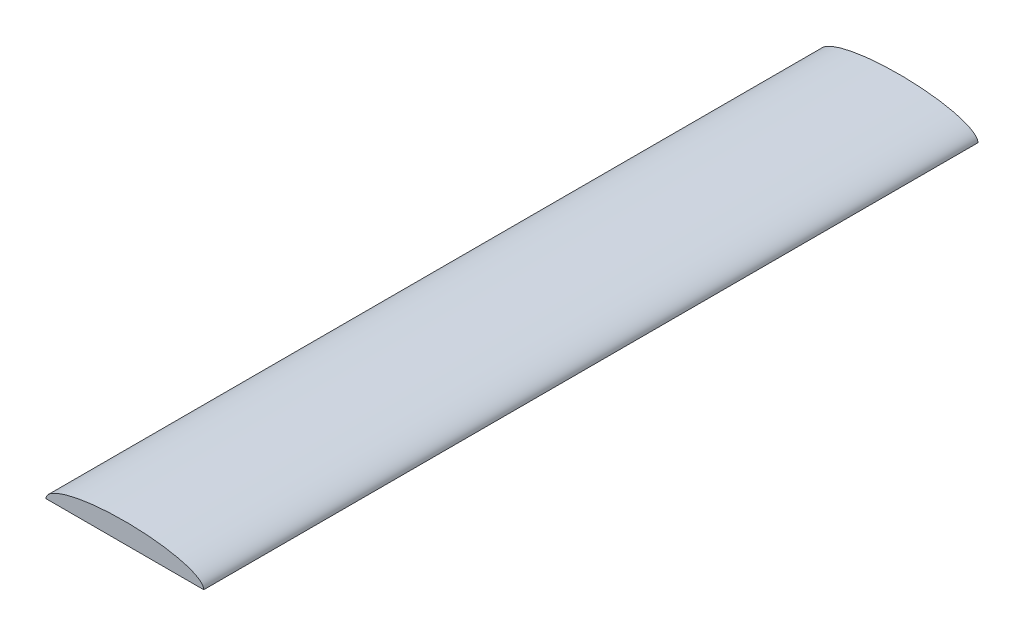
ISO-10303-21;
HEADER;
FILE_DESCRIPTION(('STEP AP214'),'2;1');
FILE_NAME('part.step','',(''),(''),'','','');
FILE_SCHEMA(('AUTOMOTIVE_DESIGN { 1 0 10303 214 1 1 1 1 }'));
ENDSEC;
DATA;
#1=APPLICATION_CONTEXT('core data for automotive mechanical design processes');
#2=APPLICATION_PROTOCOL_DEFINITION('international standard','automotive_design',2000,#1);
#3=PRODUCT_CONTEXT('',#1,'mechanical');
#4=PRODUCT('Part','Part','',(#3));
#5=PRODUCT_RELATED_PRODUCT_CATEGORY('part','',(#4));
#6=PRODUCT_DEFINITION_FORMATION('','',#4);
#7=PRODUCT_DEFINITION_CONTEXT('part definition',#1,'design');
#8=PRODUCT_DEFINITION('design','',#6,#7);
#9=PRODUCT_DEFINITION_SHAPE('','',#8);
#10=(LENGTH_UNIT() NAMED_UNIT(*) SI_UNIT(.MILLI.,.METRE.));
#11=(NAMED_UNIT(*) PLANE_ANGLE_UNIT() SI_UNIT($,.RADIAN.));
#12=(NAMED_UNIT(*) SI_UNIT($,.STERADIAN.) SOLID_ANGLE_UNIT());
#13=UNCERTAINTY_MEASURE_WITH_UNIT(LENGTH_MEASURE(1.E-05),#10,'distance_accuracy_value','');
#14=(GEOMETRIC_REPRESENTATION_CONTEXT(3) GLOBAL_UNCERTAINTY_ASSIGNED_CONTEXT((#13)) GLOBAL_UNIT_ASSIGNED_CONTEXT((#10,
#11,#12)) REPRESENTATION_CONTEXT('',''));
#15=CARTESIAN_POINT('',(0.,0.,0.));
#16=DIRECTION('',(0.,0.,1.));
#17=DIRECTION('',(1.,0.,0.));
#18=AXIS2_PLACEMENT_3D('',#15,#16,#17);
#19=CARTESIAN_POINT('',(0.,0.,12.35));
#20=DIRECTION('',(0.,0.,1.));
#21=DIRECTION('',(1.,0.,0.));
#22=AXIS2_PLACEMENT_3D('',#19,#20,#21);
#23=ELLIPSE('',#22,2.516,0.635);
#24=DIRECTION('',(0.,0.,-1.));
#25=VECTOR('',#24,1.);
#26=SURFACE_OF_LINEAR_EXTRUSION('',#23,#25);
#27=CARTESIAN_POINT('',(0.,0.,-12.35));
#28=DIRECTION('',(0.,0.,1.));
#29=DIRECTION('',(1.,0.,0.));
#30=AXIS2_PLACEMENT_3D('',#27,#28,#29);
#31=ELLIPSE('',#30,2.516,0.635);
#32=CARTESIAN_POINT('',(2.516,0.,-12.35));
#33=VERTEX_POINT('',#32);
#34=CARTESIAN_POINT('',(-2.516,0.,-12.35));
#35=VERTEX_POINT('',#34);
#36=EDGE_CURVE('E62',#33,#35,#31,.T.);
#37=ORIENTED_EDGE('',*,*,#36,.T.);
#38=DIRECTION('',(0.,0.,-1.));
#39=VECTOR('',#38,1.);
#40=CARTESIAN_POINT('',(-2.516,0.,12.35));
#41=LINE('',#40,#39);
#42=CARTESIAN_POINT('',(-2.516,0.,12.35));
#43=VERTEX_POINT('',#42);
#44=EDGE_CURVE('E11',#43,#35,#41,.T.);
#45=ORIENTED_EDGE('',*,*,#44,.F.);
#46=CARTESIAN_POINT('',(2.516,0.,12.35));
#47=VERTEX_POINT('',#46);
#48=EDGE_CURVE('E61',#47,#43,#23,.T.);
#49=ORIENTED_EDGE('',*,*,#48,.F.);
#50=DIRECTION('',(0.,0.,-1.));
#51=VECTOR('',#50,1.);
#52=CARTESIAN_POINT('',(2.516,0.,12.35));
#53=LINE('',#52,#51);
#54=EDGE_CURVE('E39',#47,#33,#53,.T.);
#55=ORIENTED_EDGE('',*,*,#54,.T.);
#56=EDGE_LOOP('',(#37,#45,#49,#55));
#57=FACE_BOUND('',#56,.T.);
#58=ADVANCED_FACE('F30',(#57),#26,.F.);
#59=CARTESIAN_POINT('',(-2.516,0.,12.35));
#60=DIRECTION('',(0.,1.,0.));
#61=DIRECTION('',(-1.,0.,0.));
#62=AXIS2_PLACEMENT_3D('',#59,#60,#61);
#63=PLANE('',#62);
#64=DIRECTION('',(1.,0.,0.));
#65=VECTOR('',#64,1.);
#66=CARTESIAN_POINT('',(-2.516,0.,-12.35));
#67=LINE('',#66,#65);
#68=EDGE_CURVE('E54',#35,#33,#67,.T.);
#69=ORIENTED_EDGE('',*,*,#68,.T.);
#70=ORIENTED_EDGE('',*,*,#54,.F.);
#71=DIRECTION('',(1.,0.,0.));
#72=VECTOR('',#71,1.);
#73=CARTESIAN_POINT('',(-2.516,0.,12.35));
#74=LINE('',#73,#72);
#75=EDGE_CURVE('E46',#43,#47,#74,.T.);
#76=ORIENTED_EDGE('',*,*,#75,.F.);
#77=ORIENTED_EDGE('',*,*,#44,.T.);
#78=EDGE_LOOP('',(#69,#70,#76,#77));
#79=FACE_BOUND('',#78,.T.);
#80=ADVANCED_FACE('F57',(#79),#63,.F.);
#81=CARTESIAN_POINT('',(0.,0.,12.35));
#82=DIRECTION('',(0.,0.,1.));
#83=DIRECTION('',(1.,0.,0.));
#84=AXIS2_PLACEMENT_3D('',#81,#82,#83);
#85=PLANE('',#84);
#86=ORIENTED_EDGE('',*,*,#48,.T.);
#87=ORIENTED_EDGE('',*,*,#75,.T.);
#88=EDGE_LOOP('',(#86,#87));
#89=FACE_BOUND('',#88,.T.);
#90=ADVANCED_FACE('F69',(#89),#85,.T.);
#91=CARTESIAN_POINT('',(0.,0.,-12.35));
#92=DIRECTION('',(0.,0.,1.));
#93=DIRECTION('',(1.,0.,0.));
#94=AXIS2_PLACEMENT_3D('',#91,#92,#93);
#95=PLANE('',#94);
#96=ORIENTED_EDGE('',*,*,#36,.F.);
#97=ORIENTED_EDGE('',*,*,#68,.F.);
#98=EDGE_LOOP('',(#96,#97));
#99=FACE_BOUND('',#98,.T.);
#100=ADVANCED_FACE('F65',(#99),#95,.F.);
#101=CLOSED_SHELL('',(#58,#80,#90,#100));
#102=MANIFOLD_SOLID_BREP('B2',#101);
#103=ADVANCED_BREP_SHAPE_REPRESENTATION('',(#18,#102),#14);
#104=SHAPE_DEFINITION_REPRESENTATION(#9,#103);
ENDSEC;
END-ISO-10303-21;
